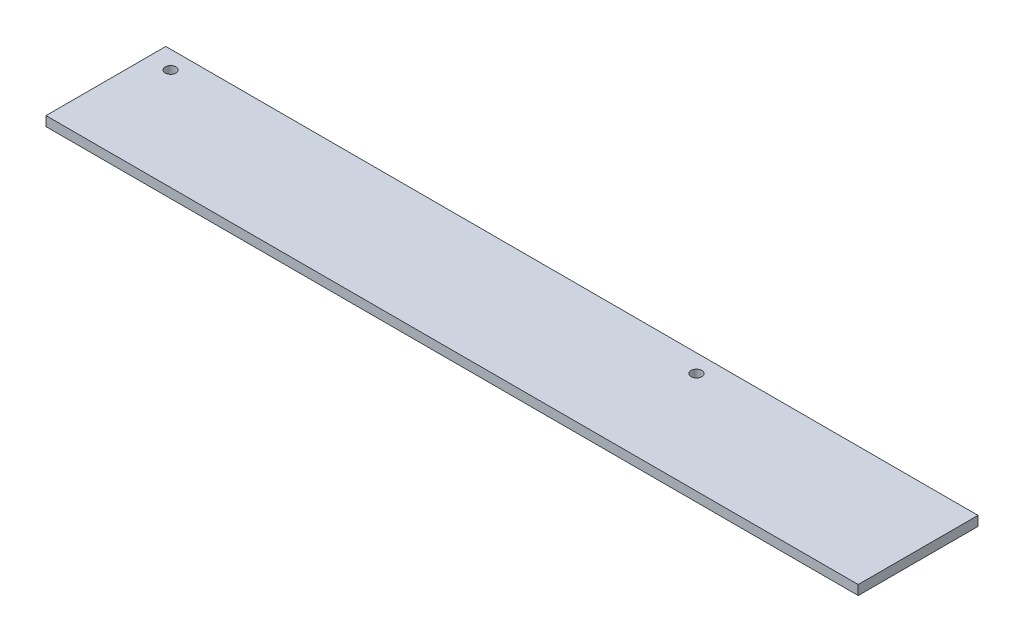
ISO-10303-21;
HEADER;
FILE_DESCRIPTION(('STEP AP214'),'2;1');
FILE_NAME('part.step','',(''),(''),'','','');
FILE_SCHEMA(('AUTOMOTIVE_DESIGN { 1 0 10303 214 1 1 1 1 }'));
ENDSEC;
DATA;
#1=APPLICATION_CONTEXT('core data for automotive mechanical design processes');
#2=APPLICATION_PROTOCOL_DEFINITION('international standard','automotive_design',2000,#1);
#3=PRODUCT_CONTEXT('',#1,'mechanical');
#4=PRODUCT('Part','Part','',(#3));
#5=PRODUCT_RELATED_PRODUCT_CATEGORY('part','',(#4));
#6=PRODUCT_DEFINITION_FORMATION('','',#4);
#7=PRODUCT_DEFINITION_CONTEXT('part definition',#1,'design');
#8=PRODUCT_DEFINITION('design','',#6,#7);
#9=PRODUCT_DEFINITION_SHAPE('','',#8);
#10=(LENGTH_UNIT() NAMED_UNIT(*) SI_UNIT(.MILLI.,.METRE.));
#11=(NAMED_UNIT(*) PLANE_ANGLE_UNIT() SI_UNIT($,.RADIAN.));
#12=(NAMED_UNIT(*) SI_UNIT($,.STERADIAN.) SOLID_ANGLE_UNIT());
#13=UNCERTAINTY_MEASURE_WITH_UNIT(LENGTH_MEASURE(1.E-05),#10,'distance_accuracy_value','');
#14=(GEOMETRIC_REPRESENTATION_CONTEXT(3) GLOBAL_UNCERTAINTY_ASSIGNED_CONTEXT((#13)) GLOBAL_UNIT_ASSIGNED_CONTEXT((#10,
#11,#12)) REPRESENTATION_CONTEXT('',''));
#15=CARTESIAN_POINT('',(0.,0.,0.));
#16=DIRECTION('',(0.,0.,1.));
#17=DIRECTION('',(1.,0.,0.));
#18=AXIS2_PLACEMENT_3D('',#15,#16,#17);
#19=CARTESIAN_POINT('',(339.,-2.,-25.));
#20=DIRECTION('',(0.,0.,1.));
#21=DIRECTION('',(1.,0.,0.));
#22=AXIS2_PLACEMENT_3D('',#19,#20,#21);
#23=PLANE('',#22);
#24=DIRECTION('',(0.,1.,0.));
#25=VECTOR('',#24,1.);
#26=CARTESIAN_POINT('',(0.,-2.,-25.));
#27=LINE('',#26,#25);
#28=CARTESIAN_POINT('',(0.,-2.,-25.));
#29=VERTEX_POINT('',#28);
#30=CARTESIAN_POINT('',(0.,2.,-25.));
#31=VERTEX_POINT('',#30);
#32=EDGE_CURVE('E98',#29,#31,#27,.T.);
#33=ORIENTED_EDGE('',*,*,#32,.T.);
#34=DIRECTION('',(-1.,0.,0.));
#35=VECTOR('',#34,1.);
#36=CARTESIAN_POINT('',(339.,2.,-25.));
#37=LINE('',#36,#35);
#38=CARTESIAN_POINT('',(339.,2.,-25.));
#39=VERTEX_POINT('',#38);
#40=EDGE_CURVE('E11',#39,#31,#37,.T.);
#41=ORIENTED_EDGE('',*,*,#40,.F.);
#42=DIRECTION('',(0.,1.,0.));
#43=VECTOR('',#42,1.);
#44=CARTESIAN_POINT('',(339.,-2.,-25.));
#45=LINE('',#44,#43);
#46=CARTESIAN_POINT('',(339.,-2.,-25.));
#47=VERTEX_POINT('',#46);
#48=EDGE_CURVE('E86',#47,#39,#45,.T.);
#49=ORIENTED_EDGE('',*,*,#48,.F.);
#50=DIRECTION('',(-1.,0.,0.));
#51=VECTOR('',#50,1.);
#52=CARTESIAN_POINT('',(339.,-2.,-25.));
#53=LINE('',#52,#51);
#54=EDGE_CURVE('E94',#47,#29,#53,.T.);
#55=ORIENTED_EDGE('',*,*,#54,.T.);
#56=EDGE_LOOP('',(#33,#41,#49,#55));
#57=FACE_BOUND('',#56,.T.);
#58=ADVANCED_FACE('F35',(#57),#23,.F.);
#59=CARTESIAN_POINT('',(339.,2.,25.));
#60=DIRECTION('',(0.,-1.,0.));
#61=DIRECTION('',(0.,0.,-1.));
#62=AXIS2_PLACEMENT_3D('',#59,#60,#61);
#63=PLANE('',#62);
#64=CARTESIAN_POINT('',(9.5,2.,-17.5));
#65=DIRECTION('',(0.,1.,0.));
#66=DIRECTION('',(0.,0.,1.));
#67=AXIS2_PLACEMENT_3D('',#64,#65,#66);
#68=CIRCLE('',#67,2.25);
#69=CARTESIAN_POINT('',(9.5,2.,-15.25));
#70=VERTEX_POINT('',#69);
#71=EDGE_CURVE('E118',#70,#70,#68,.T.);
#72=ORIENTED_EDGE('',*,*,#71,.F.);
#73=EDGE_LOOP('',(#72));
#74=FACE_BOUND('',#73,.T.);
#75=CARTESIAN_POINT('',(229.,2.,-17.5));
#76=DIRECTION('',(0.,1.,0.));
#77=DIRECTION('',(0.,0.,1.));
#78=AXIS2_PLACEMENT_3D('',#75,#76,#77);
#79=CIRCLE('',#78,2.24999999999995);
#80=CARTESIAN_POINT('',(229.,2.,-15.2500000000001));
#81=VERTEX_POINT('',#80);
#82=EDGE_CURVE('E112',#81,#81,#79,.T.);
#83=ORIENTED_EDGE('',*,*,#82,.F.);
#84=EDGE_LOOP('',(#83));
#85=FACE_BOUND('',#84,.T.);
#86=DIRECTION('',(0.,0.,1.));
#87=VECTOR('',#86,1.);
#88=CARTESIAN_POINT('',(0.,2.,25.));
#89=LINE('',#88,#87);
#90=CARTESIAN_POINT('',(0.,2.,25.));
#91=VERTEX_POINT('',#90);
#92=EDGE_CURVE('E90',#31,#91,#89,.T.);
#93=ORIENTED_EDGE('',*,*,#92,.T.);
#94=DIRECTION('',(-1.,0.,0.));
#95=VECTOR('',#94,1.);
#96=CARTESIAN_POINT('',(339.,2.,25.));
#97=LINE('',#96,#95);
#98=CARTESIAN_POINT('',(339.,2.,25.));
#99=VERTEX_POINT('',#98);
#100=EDGE_CURVE('E43',#99,#91,#97,.T.);
#101=ORIENTED_EDGE('',*,*,#100,.F.);
#102=DIRECTION('',(0.,0.,1.));
#103=VECTOR('',#102,1.);
#104=CARTESIAN_POINT('',(339.,2.,25.));
#105=LINE('',#104,#103);
#106=EDGE_CURVE('E81',#39,#99,#105,.T.);
#107=ORIENTED_EDGE('',*,*,#106,.F.);
#108=ORIENTED_EDGE('',*,*,#40,.T.);
#109=EDGE_LOOP('',(#93,#101,#107,#108));
#110=FACE_BOUND('',#109,.T.);
#111=ADVANCED_FACE('F89',(#74,#85,#110),#63,.F.);
#112=CARTESIAN_POINT('',(339.,-2.,25.));
#113=DIRECTION('',(0.,0.,-1.));
#114=DIRECTION('',(-1.,0.,0.));
#115=AXIS2_PLACEMENT_3D('',#112,#113,#114);
#116=PLANE('',#115);
#117=DIRECTION('',(0.,-1.,0.));
#118=VECTOR('',#117,1.);
#119=CARTESIAN_POINT('',(0.,-2.,25.));
#120=LINE('',#119,#118);
#121=CARTESIAN_POINT('',(0.,-2.,25.));
#122=VERTEX_POINT('',#121);
#123=EDGE_CURVE('E68',#91,#122,#120,.T.);
#124=ORIENTED_EDGE('',*,*,#123,.T.);
#125=DIRECTION('',(-1.,0.,0.));
#126=VECTOR('',#125,1.);
#127=CARTESIAN_POINT('',(339.,-2.,25.));
#128=LINE('',#127,#126);
#129=CARTESIAN_POINT('',(339.,-2.,25.));
#130=VERTEX_POINT('',#129);
#131=EDGE_CURVE('E91',#130,#122,#128,.T.);
#132=ORIENTED_EDGE('',*,*,#131,.F.);
#133=DIRECTION('',(0.,-1.,0.));
#134=VECTOR('',#133,1.);
#135=CARTESIAN_POINT('',(339.,-2.,25.));
#136=LINE('',#135,#134);
#137=EDGE_CURVE('E84',#99,#130,#136,.T.);
#138=ORIENTED_EDGE('',*,*,#137,.F.);
#139=ORIENTED_EDGE('',*,*,#100,.T.);
#140=EDGE_LOOP('',(#124,#132,#138,#139));
#141=FACE_BOUND('',#140,.T.);
#142=ADVANCED_FACE('F92',(#141),#116,.F.);
#143=CARTESIAN_POINT('',(339.,-2.,25.));
#144=DIRECTION('',(0.,1.,0.));
#145=DIRECTION('',(0.,0.,1.));
#146=AXIS2_PLACEMENT_3D('',#143,#144,#145);
#147=PLANE('',#146);
#148=CARTESIAN_POINT('',(9.5,-2.,-17.5));
#149=DIRECTION('',(0.,1.,0.));
#150=DIRECTION('',(0.,0.,1.));
#151=AXIS2_PLACEMENT_3D('',#148,#149,#150);
#152=CIRCLE('',#151,2.25);
#153=CARTESIAN_POINT('',(9.5,-2.,-15.25));
#154=VERTEX_POINT('',#153);
#155=EDGE_CURVE('E101',#154,#154,#152,.T.);
#156=ORIENTED_EDGE('',*,*,#155,.T.);
#157=EDGE_LOOP('',(#156));
#158=FACE_BOUND('',#157,.T.);
#159=CARTESIAN_POINT('',(229.,-2.,-17.5));
#160=DIRECTION('',(0.,1.,0.));
#161=DIRECTION('',(0.,0.,1.));
#162=AXIS2_PLACEMENT_3D('',#159,#160,#161);
#163=CIRCLE('',#162,2.24999999999995);
#164=CARTESIAN_POINT('',(229.,-2.,-15.2500000000001));
#165=VERTEX_POINT('',#164);
#166=EDGE_CURVE('E115',#165,#165,#163,.T.);
#167=ORIENTED_EDGE('',*,*,#166,.T.);
#168=EDGE_LOOP('',(#167));
#169=FACE_BOUND('',#168,.T.);
#170=DIRECTION('',(0.,0.,-1.));
#171=VECTOR('',#170,1.);
#172=CARTESIAN_POINT('',(0.,-2.,25.));
#173=LINE('',#172,#171);
#174=EDGE_CURVE('E74',#122,#29,#173,.T.);
#175=ORIENTED_EDGE('',*,*,#174,.T.);
#176=ORIENTED_EDGE('',*,*,#54,.F.);
#177=DIRECTION('',(0.,0.,-1.));
#178=VECTOR('',#177,1.);
#179=CARTESIAN_POINT('',(339.,-2.,25.));
#180=LINE('',#179,#178);
#181=EDGE_CURVE('E51',#130,#47,#180,.T.);
#182=ORIENTED_EDGE('',*,*,#181,.F.);
#183=ORIENTED_EDGE('',*,*,#131,.T.);
#184=EDGE_LOOP('',(#175,#176,#182,#183));
#185=FACE_BOUND('',#184,.T.);
#186=ADVANCED_FACE('F106',(#158,#169,#185),#147,.F.);
#187=CARTESIAN_POINT('',(339.,0.,0.));
#188=DIRECTION('',(-1.,0.,0.));
#189=DIRECTION('',(0.,0.,1.));
#190=AXIS2_PLACEMENT_3D('',#187,#188,#189);
#191=PLANE('',#190);
#192=ORIENTED_EDGE('',*,*,#48,.T.);
#193=ORIENTED_EDGE('',*,*,#106,.T.);
#194=ORIENTED_EDGE('',*,*,#137,.T.);
#195=ORIENTED_EDGE('',*,*,#181,.T.);
#196=EDGE_LOOP('',(#192,#193,#194,#195));
#197=FACE_BOUND('',#196,.T.);
#198=ADVANCED_FACE('F82',(#197),#191,.F.);
#199=CARTESIAN_POINT('',(0.,0.,0.));
#200=DIRECTION('',(-1.,0.,0.));
#201=DIRECTION('',(0.,0.,1.));
#202=AXIS2_PLACEMENT_3D('',#199,#200,#201);
#203=PLANE('',#202);
#204=ORIENTED_EDGE('',*,*,#32,.F.);
#205=ORIENTED_EDGE('',*,*,#174,.F.);
#206=ORIENTED_EDGE('',*,*,#123,.F.);
#207=ORIENTED_EDGE('',*,*,#92,.F.);
#208=EDGE_LOOP('',(#204,#205,#206,#207));
#209=FACE_BOUND('',#208,.T.);
#210=ADVANCED_FACE('F109',(#209),#203,.T.);
#211=CARTESIAN_POINT('',(229.,-2.,-17.5));
#212=DIRECTION('',(0.,1.,0.));
#213=DIRECTION('',(0.,0.,1.));
#214=AXIS2_PLACEMENT_3D('',#211,#212,#213);
#215=CYLINDRICAL_SURFACE('',#214,2.24999999999995);
#216=ORIENTED_EDGE('',*,*,#166,.F.);
#217=EDGE_LOOP('',(#216));
#218=FACE_BOUND('',#217,.T.);
#219=ORIENTED_EDGE('',*,*,#82,.T.);
#220=EDGE_LOOP('',(#219));
#221=FACE_BOUND('',#220,.T.);
#222=ADVANCED_FACE('F129',(#218,#221),#215,.F.);
#223=CARTESIAN_POINT('',(9.5,-2.,-17.5));
#224=DIRECTION('',(0.,1.,0.));
#225=DIRECTION('',(0.,0.,1.));
#226=AXIS2_PLACEMENT_3D('',#223,#224,#225);
#227=CYLINDRICAL_SURFACE('',#226,2.25);
#228=ORIENTED_EDGE('',*,*,#155,.F.);
#229=EDGE_LOOP('',(#228));
#230=FACE_BOUND('',#229,.T.);
#231=ORIENTED_EDGE('',*,*,#71,.T.);
#232=EDGE_LOOP('',(#231));
#233=FACE_BOUND('',#232,.T.);
#234=ADVANCED_FACE('F126',(#230,#233),#227,.F.);
#235=CLOSED_SHELL('',(#58,#111,#142,#186,#198,#210,#222,#234));
#236=MANIFOLD_SOLID_BREP('B2',#235);
#237=ADVANCED_BREP_SHAPE_REPRESENTATION('',(#18,#236),#14);
#238=SHAPE_DEFINITION_REPRESENTATION(#9,#237);
ENDSEC;
END-ISO-10303-21;
